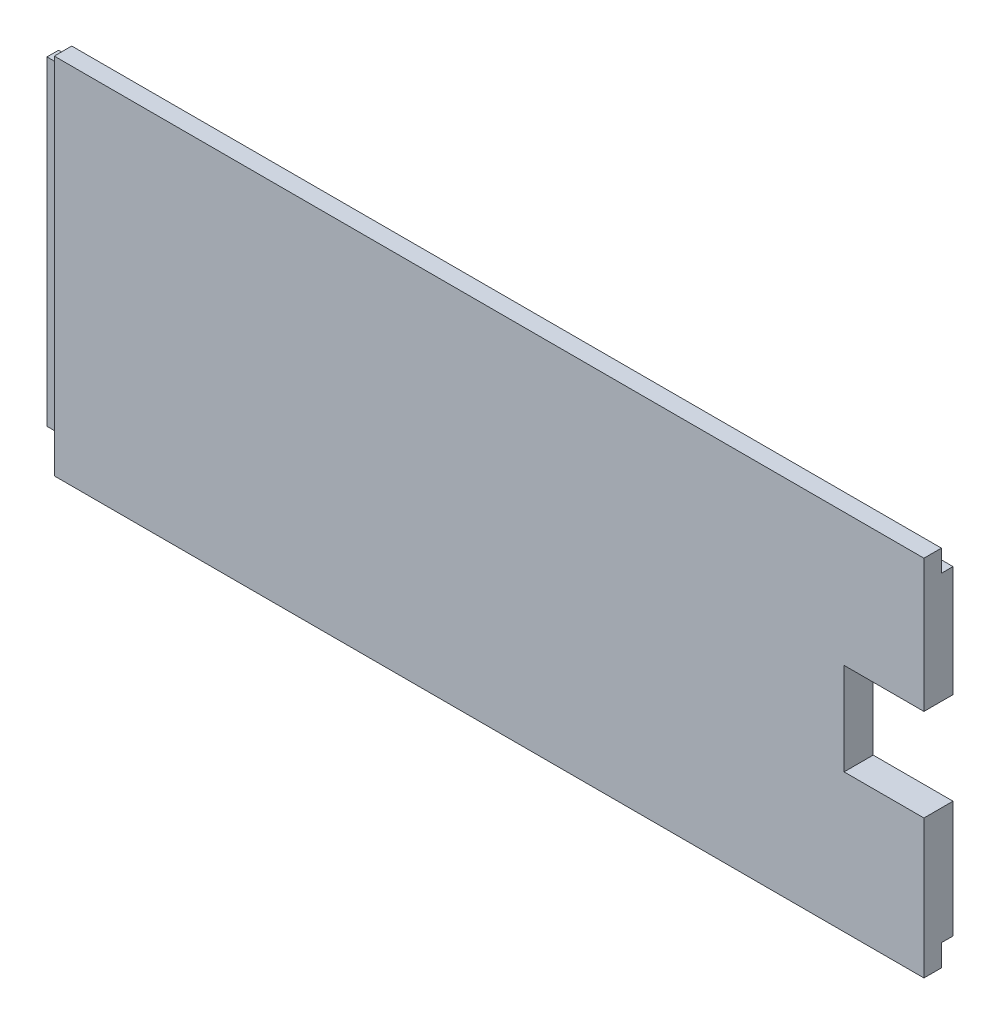
ISO-10303-21;
HEADER;
FILE_DESCRIPTION(('STEP AP214'),'2;1');
FILE_NAME('part.step','',(''),(''),'','','');
FILE_SCHEMA(('AUTOMOTIVE_DESIGN { 1 0 10303 214 1 1 1 1 }'));
ENDSEC;
DATA;
#1=APPLICATION_CONTEXT('core data for automotive mechanical design processes');
#2=APPLICATION_PROTOCOL_DEFINITION('international standard','automotive_design',2000,#1);
#3=PRODUCT_CONTEXT('',#1,'mechanical');
#4=PRODUCT('Part','Part','',(#3));
#5=PRODUCT_RELATED_PRODUCT_CATEGORY('part','',(#4));
#6=PRODUCT_DEFINITION_FORMATION('','',#4);
#7=PRODUCT_DEFINITION_CONTEXT('part definition',#1,'design');
#8=PRODUCT_DEFINITION('design','',#6,#7);
#9=PRODUCT_DEFINITION_SHAPE('','',#8);
#10=(LENGTH_UNIT() NAMED_UNIT(*) SI_UNIT(.MILLI.,.METRE.));
#11=(NAMED_UNIT(*) PLANE_ANGLE_UNIT() SI_UNIT($,.RADIAN.));
#12=(NAMED_UNIT(*) SI_UNIT($,.STERADIAN.) SOLID_ANGLE_UNIT());
#13=UNCERTAINTY_MEASURE_WITH_UNIT(LENGTH_MEASURE(1.E-05),#10,'distance_accuracy_value','');
#14=(GEOMETRIC_REPRESENTATION_CONTEXT(3) GLOBAL_UNCERTAINTY_ASSIGNED_CONTEXT((#13)) GLOBAL_UNIT_ASSIGNED_CONTEXT((#10,
#11,#12)) REPRESENTATION_CONTEXT('',''));
#15=CARTESIAN_POINT('',(0.,0.,0.));
#16=DIRECTION('',(0.,0.,1.));
#17=DIRECTION('',(1.,0.,0.));
#18=AXIS2_PLACEMENT_3D('',#15,#16,#17);
#19=CARTESIAN_POINT('',(153.914845761388,-5.35693257759517,2.032));
#20=DIRECTION('',(-1.,0.,0.));
#21=DIRECTION('',(0.,0.,1.));
#22=AXIS2_PLACEMENT_3D('',#19,#20,#21);
#23=PLANE('',#22);
#24=DIRECTION('',(0.,1.,0.));
#25=VECTOR('',#24,1.);
#26=CARTESIAN_POINT('',(153.914845761388,-5.35693257759517,0.));
#27=LINE('',#26,#25);
#28=CARTESIAN_POINT('',(153.914845761388,-5.35693257759517,0.));
#29=VERTEX_POINT('',#28);
#30=CARTESIAN_POINT('',(153.914845761388,15.0372109981565,0.));
#31=VERTEX_POINT('',#30);
#32=EDGE_CURVE('E166',#29,#31,#27,.T.);
#33=ORIENTED_EDGE('',*,*,#32,.T.);
#34=DIRECTION('',(0.,0.,1.));
#35=VECTOR('',#34,1.);
#36=CARTESIAN_POINT('',(153.914845761388,15.0372109981565,0.));
#37=LINE('',#36,#35);
#38=CARTESIAN_POINT('',(153.914845761388,15.0372109981565,5.08));
#39=VERTEX_POINT('',#38);
#40=EDGE_CURVE('E262',#31,#39,#37,.T.);
#41=ORIENTED_EDGE('',*,*,#40,.T.);
#42=DIRECTION('',(0.,1.,0.));
#43=VECTOR('',#42,1.);
#44=CARTESIAN_POINT('',(153.914845761388,54.3330674224048,5.08));
#45=LINE('',#44,#43);
#46=CARTESIAN_POINT('',(153.914845761388,-9.16693257759518,5.08));
#47=VERTEX_POINT('',#46);
#48=EDGE_CURVE('E247',#47,#39,#45,.T.);
#49=ORIENTED_EDGE('',*,*,#48,.F.);
#50=DIRECTION('',(0.,0.,-1.));
#51=VECTOR('',#50,1.);
#52=CARTESIAN_POINT('',(153.914845761388,-9.16693257759518,5.08));
#53=LINE('',#52,#51);
#54=CARTESIAN_POINT('',(153.914845761388,-9.16693257759518,2.032));
#55=VERTEX_POINT('',#54);
#56=EDGE_CURVE('E208',#47,#55,#53,.T.);
#57=ORIENTED_EDGE('',*,*,#56,.T.);
#58=DIRECTION('',(0.,1.,0.));
#59=VECTOR('',#58,1.);
#60=CARTESIAN_POINT('',(153.914845761388,54.3330674224048,2.032));
#61=LINE('',#60,#59);
#62=CARTESIAN_POINT('',(153.914845761388,-5.35693257759517,2.032));
#63=VERTEX_POINT('',#62);
#64=EDGE_CURVE('E236',#55,#63,#61,.T.);
#65=ORIENTED_EDGE('',*,*,#64,.T.);
#66=DIRECTION('',(0.,0.,-1.));
#67=VECTOR('',#66,1.);
#68=CARTESIAN_POINT('',(153.914845761388,-5.35693257759517,2.032));
#69=LINE('',#68,#67);
#70=EDGE_CURVE('E186',#63,#29,#69,.T.);
#71=ORIENTED_EDGE('',*,*,#70,.T.);
#72=EDGE_LOOP('',(#33,#41,#49,#57,#65,#71));
#73=FACE_BOUND('',#72,.T.);
#74=ADVANCED_FACE('F43',(#73),#23,.F.);
#75=CARTESIAN_POINT('',(0.,0.,2.032));
#76=DIRECTION('',(0.,0.,-1.));
#77=DIRECTION('',(-1.,0.,0.));
#78=AXIS2_PLACEMENT_3D('',#75,#76,#77);
#79=PLANE('',#78);
#80=DIRECTION('',(0.,-1.,0.));
#81=VECTOR('',#80,1.);
#82=CARTESIAN_POINT('',(2.02607794983212,54.3330674224048,2.032));
#83=LINE('',#82,#81);
#84=CARTESIAN_POINT('',(2.02607794983212,50.5230674224048,2.032));
#85=VERTEX_POINT('',#84);
#86=CARTESIAN_POINT('',(2.02607794983212,-5.35693257759515,2.032));
#87=VERTEX_POINT('',#86);
#88=EDGE_CURVE('E11',#85,#87,#83,.T.);
#89=ORIENTED_EDGE('',*,*,#88,.F.);
#90=DIRECTION('',(-1.,0.,0.));
#91=VECTOR('',#90,1.);
#92=CARTESIAN_POINT('',(-2.29515423861217,50.5230674224048,2.032));
#93=LINE('',#92,#91);
#94=CARTESIAN_POINT('',(-2.29515423861217,50.5230674224048,2.032));
#95=VERTEX_POINT('',#94);
#96=EDGE_CURVE('E214',#85,#95,#93,.T.);
#97=ORIENTED_EDGE('',*,*,#96,.T.);
#98=DIRECTION('',(0.,-1.,0.));
#99=VECTOR('',#98,1.);
#100=CARTESIAN_POINT('',(-2.29515423861217,-5.35693257759517,2.032));
#101=LINE('',#100,#99);
#102=CARTESIAN_POINT('',(-2.29515423861217,-5.35693257759517,2.032));
#103=VERTEX_POINT('',#102);
#104=EDGE_CURVE('E178',#95,#103,#101,.T.);
#105=ORIENTED_EDGE('',*,*,#104,.T.);
#106=DIRECTION('',(1.,0.,0.));
#107=VECTOR('',#106,1.);
#108=CARTESIAN_POINT('',(-2.29515423861217,-5.35693257759517,2.032));
#109=LINE('',#108,#107);
#110=EDGE_CURVE('E199',#103,#87,#109,.T.);
#111=ORIENTED_EDGE('',*,*,#110,.T.);
#112=EDGE_LOOP('',(#89,#97,#105,#111));
#113=FACE_BOUND('',#112,.T.);
#114=ADVANCED_FACE('F301',(#113),#79,.F.);
#115=CARTESIAN_POINT('',(-2.29515423861217,-5.35693257759517,2.032));
#116=DIRECTION('',(1.,0.,0.));
#117=DIRECTION('',(0.,0.,-1.));
#118=AXIS2_PLACEMENT_3D('',#115,#116,#117);
#119=PLANE('',#118);
#120=DIRECTION('',(0.,-1.,0.));
#121=VECTOR('',#120,1.);
#122=CARTESIAN_POINT('',(-2.29515423861217,-5.35693257759517,0.));
#123=LINE('',#122,#121);
#124=CARTESIAN_POINT('',(-2.29515423861217,50.5230674224048,0.));
#125=VERTEX_POINT('',#124);
#126=CARTESIAN_POINT('',(-2.29515423861217,-5.35693257759517,0.));
#127=VERTEX_POINT('',#126);
#128=EDGE_CURVE('E172',#125,#127,#123,.T.);
#129=ORIENTED_EDGE('',*,*,#128,.T.);
#130=DIRECTION('',(0.,0.,-1.));
#131=VECTOR('',#130,1.);
#132=CARTESIAN_POINT('',(-2.29515423861217,-5.35693257759517,2.032));
#133=LINE('',#132,#131);
#134=EDGE_CURVE('E47',#103,#127,#133,.T.);
#135=ORIENTED_EDGE('',*,*,#134,.F.);
#136=ORIENTED_EDGE('',*,*,#104,.F.);
#137=DIRECTION('',(0.,0.,-1.));
#138=VECTOR('',#137,1.);
#139=CARTESIAN_POINT('',(-2.29515423861217,50.5230674224048,2.032));
#140=LINE('',#139,#138);
#141=EDGE_CURVE('E179',#95,#125,#140,.T.);
#142=ORIENTED_EDGE('',*,*,#141,.T.);
#143=EDGE_LOOP('',(#129,#135,#136,#142));
#144=FACE_BOUND('',#143,.T.);
#145=ADVANCED_FACE('F45',(#144),#119,.F.);
#146=CARTESIAN_POINT('',(-2.29515423861217,-5.35693257759517,2.032));
#147=DIRECTION('',(0.,1.,0.));
#148=DIRECTION('',(0.,0.,1.));
#149=AXIS2_PLACEMENT_3D('',#146,#147,#148);
#150=PLANE('',#149);
#151=DIRECTION('',(1.,0.,0.));
#152=VECTOR('',#151,1.);
#153=CARTESIAN_POINT('',(-2.29515423861217,-5.35693257759517,0.));
#154=LINE('',#153,#152);
#155=EDGE_CURVE('E167',#127,#29,#154,.T.);
#156=ORIENTED_EDGE('',*,*,#155,.T.);
#157=ORIENTED_EDGE('',*,*,#70,.F.);
#158=EDGE_CURVE('E217',#87,#63,#109,.T.);
#159=ORIENTED_EDGE('',*,*,#158,.F.);
#160=ORIENTED_EDGE('',*,*,#110,.F.);
#161=ORIENTED_EDGE('',*,*,#134,.T.);
#162=EDGE_LOOP('',(#156,#157,#159,#160,#161));
#163=FACE_BOUND('',#162,.T.);
#164=ADVANCED_FACE('F197',(#163),#150,.F.);
#165=CARTESIAN_POINT('',(153.914845761388,31.1487288611217,5.08));
#166=VERTEX_POINT('',#165);
#167=CARTESIAN_POINT('',(153.914845761388,54.3330674224048,5.08));
#168=VERTEX_POINT('',#167);
#169=EDGE_CURVE('E156',#166,#168,#45,.T.);
#170=ORIENTED_EDGE('',*,*,#169,.F.);
#171=DIRECTION('',(0.,0.,1.));
#172=VECTOR('',#171,1.);
#173=CARTESIAN_POINT('',(153.914845761388,31.1487288611217,0.));
#174=LINE('',#173,#172);
#175=CARTESIAN_POINT('',(153.914845761388,31.1487288611217,0.));
#176=VERTEX_POINT('',#175);
#177=EDGE_CURVE('E62',#176,#166,#174,.T.);
#178=ORIENTED_EDGE('',*,*,#177,.F.);
#179=CARTESIAN_POINT('',(153.914845761388,50.5230674224048,0.));
#180=VERTEX_POINT('',#179);
#181=EDGE_CURVE('E153',#176,#180,#27,.T.);
#182=ORIENTED_EDGE('',*,*,#181,.T.);
#183=DIRECTION('',(0.,0.,-1.));
#184=VECTOR('',#183,1.);
#185=CARTESIAN_POINT('',(153.914845761388,50.5230674224048,2.032));
#186=LINE('',#185,#184);
#187=CARTESIAN_POINT('',(153.914845761388,50.5230674224048,2.032));
#188=VERTEX_POINT('',#187);
#189=EDGE_CURVE('E183',#188,#180,#186,.T.);
#190=ORIENTED_EDGE('',*,*,#189,.F.);
#191=CARTESIAN_POINT('',(153.914845761388,54.3330674224048,2.032));
#192=VERTEX_POINT('',#191);
#193=EDGE_CURVE('E239',#188,#192,#61,.T.);
#194=ORIENTED_EDGE('',*,*,#193,.T.);
#195=DIRECTION('',(0.,0.,-1.));
#196=VECTOR('',#195,1.);
#197=CARTESIAN_POINT('',(153.914845761388,54.3330674224048,5.08));
#198=LINE('',#197,#196);
#199=EDGE_CURVE('E223',#168,#192,#198,.T.);
#200=ORIENTED_EDGE('',*,*,#199,.F.);
#201=EDGE_LOOP('',(#170,#178,#182,#190,#194,#200));
#202=FACE_BOUND('',#201,.T.);
#203=ADVANCED_FACE('F152',(#202),#23,.F.);
#204=CARTESIAN_POINT('',(-2.29515423861217,50.5230674224048,2.032));
#205=DIRECTION('',(0.,-1.,0.));
#206=DIRECTION('',(0.,0.,-1.));
#207=AXIS2_PLACEMENT_3D('',#204,#205,#206);
#208=PLANE('',#207);
#209=DIRECTION('',(-1.,0.,0.));
#210=VECTOR('',#209,1.);
#211=CARTESIAN_POINT('',(-2.29515423861217,50.5230674224048,0.));
#212=LINE('',#211,#210);
#213=EDGE_CURVE('E164',#180,#125,#212,.T.);
#214=ORIENTED_EDGE('',*,*,#213,.T.);
#215=ORIENTED_EDGE('',*,*,#141,.F.);
#216=ORIENTED_EDGE('',*,*,#96,.F.);
#217=EDGE_CURVE('E184',#188,#85,#93,.T.);
#218=ORIENTED_EDGE('',*,*,#217,.F.);
#219=ORIENTED_EDGE('',*,*,#189,.T.);
#220=EDGE_LOOP('',(#214,#215,#216,#218,#219));
#221=FACE_BOUND('',#220,.T.);
#222=ADVANCED_FACE('F304',(#221),#208,.F.);
#223=CARTESIAN_POINT('',(0.,0.,0.));
#224=DIRECTION('',(0.,0.,-1.));
#225=DIRECTION('',(-1.,0.,0.));
#226=AXIS2_PLACEMENT_3D('',#223,#224,#225);
#227=PLANE('',#226);
#228=DIRECTION('',(1.,0.,0.));
#229=VECTOR('',#228,1.);
#230=CARTESIAN_POINT('',(153.914845761388,15.0372109981565,0.));
#231=LINE('',#230,#229);
#232=CARTESIAN_POINT('',(139.973048170908,15.0372109981565,0.));
#233=VERTEX_POINT('',#232);
#234=EDGE_CURVE('E158',#233,#31,#231,.T.);
#235=ORIENTED_EDGE('',*,*,#234,.T.);
#236=ORIENTED_EDGE('',*,*,#32,.F.);
#237=ORIENTED_EDGE('',*,*,#155,.F.);
#238=ORIENTED_EDGE('',*,*,#128,.F.);
#239=ORIENTED_EDGE('',*,*,#213,.F.);
#240=ORIENTED_EDGE('',*,*,#181,.F.);
#241=DIRECTION('',(-1.,0.,0.));
#242=VECTOR('',#241,1.);
#243=CARTESIAN_POINT('',(153.914845761388,31.1487288611217,0.));
#244=LINE('',#243,#242);
#245=CARTESIAN_POINT('',(139.973048170908,31.1487288611217,0.));
#246=VERTEX_POINT('',#245);
#247=EDGE_CURVE('E139',#176,#246,#244,.T.);
#248=ORIENTED_EDGE('',*,*,#247,.T.);
#249=DIRECTION('',(0.,-1.,0.));
#250=VECTOR('',#249,1.);
#251=CARTESIAN_POINT('',(139.973048170908,15.0372109981565,0.));
#252=LINE('',#251,#250);
#253=EDGE_CURVE('E147',#246,#233,#252,.T.);
#254=ORIENTED_EDGE('',*,*,#253,.T.);
#255=EDGE_LOOP('',(#235,#236,#237,#238,#239,#240,#248,#254));
#256=FACE_BOUND('',#255,.T.);
#257=ADVANCED_FACE('F162',(#256),#227,.T.);
#258=CARTESIAN_POINT('',(0.,0.,2.032));
#259=DIRECTION('',(0.,0.,1.));
#260=DIRECTION('',(1.,0.,0.));
#261=AXIS2_PLACEMENT_3D('',#258,#259,#260);
#262=PLANE('',#261);
#263=CARTESIAN_POINT('',(2.02607794983212,-9.16693257759518,2.032));
#264=VERTEX_POINT('',#263);
#265=EDGE_CURVE('E55',#87,#264,#83,.T.);
#266=ORIENTED_EDGE('',*,*,#265,.F.);
#267=ORIENTED_EDGE('',*,*,#158,.T.);
#268=ORIENTED_EDGE('',*,*,#64,.F.);
#269=DIRECTION('',(1.,0.,0.));
#270=VECTOR('',#269,1.);
#271=CARTESIAN_POINT('',(2.02607794983212,-9.16693257759518,2.032));
#272=LINE('',#271,#270);
#273=EDGE_CURVE('E240',#264,#55,#272,.T.);
#274=ORIENTED_EDGE('',*,*,#273,.F.);
#275=EDGE_LOOP('',(#266,#267,#268,#274));
#276=FACE_BOUND('',#275,.T.);
#277=ADVANCED_FACE('F298',(#276),#262,.F.);
#278=ORIENTED_EDGE('',*,*,#193,.F.);
#279=ORIENTED_EDGE('',*,*,#217,.T.);
#280=CARTESIAN_POINT('',(2.02607794983212,54.3330674224048,2.032));
#281=VERTEX_POINT('',#280);
#282=EDGE_CURVE('E54',#281,#85,#83,.T.);
#283=ORIENTED_EDGE('',*,*,#282,.F.);
#284=DIRECTION('',(-1.,0.,0.));
#285=VECTOR('',#284,1.);
#286=CARTESIAN_POINT('',(2.02607794983212,54.3330674224048,2.032));
#287=LINE('',#286,#285);
#288=EDGE_CURVE('E232',#192,#281,#287,.T.);
#289=ORIENTED_EDGE('',*,*,#288,.F.);
#290=EDGE_LOOP('',(#278,#279,#283,#289));
#291=FACE_BOUND('',#290,.T.);
#292=ADVANCED_FACE('F314',(#291),#262,.F.);
#293=CARTESIAN_POINT('',(2.02607794983212,54.3330674224048,5.08));
#294=DIRECTION('',(1.,0.,0.));
#295=DIRECTION('',(0.,0.,-1.));
#296=AXIS2_PLACEMENT_3D('',#293,#294,#295);
#297=PLANE('',#296);
#298=ORIENTED_EDGE('',*,*,#282,.T.);
#299=ORIENTED_EDGE('',*,*,#88,.T.);
#300=ORIENTED_EDGE('',*,*,#265,.T.);
#301=DIRECTION('',(0.,0.,-1.));
#302=VECTOR('',#301,1.);
#303=CARTESIAN_POINT('',(2.02607794983212,-9.16693257759518,5.08));
#304=LINE('',#303,#302);
#305=CARTESIAN_POINT('',(2.02607794983212,-9.16693257759518,5.08));
#306=VERTEX_POINT('',#305);
#307=EDGE_CURVE('E205',#306,#264,#304,.T.);
#308=ORIENTED_EDGE('',*,*,#307,.F.);
#309=DIRECTION('',(0.,-1.,0.));
#310=VECTOR('',#309,1.);
#311=CARTESIAN_POINT('',(2.02607794983212,54.3330674224048,5.08));
#312=LINE('',#311,#310);
#313=CARTESIAN_POINT('',(2.02607794983212,54.3330674224048,5.08));
#314=VERTEX_POINT('',#313);
#315=EDGE_CURVE('E235',#314,#306,#312,.T.);
#316=ORIENTED_EDGE('',*,*,#315,.F.);
#317=DIRECTION('',(0.,0.,-1.));
#318=VECTOR('',#317,1.);
#319=CARTESIAN_POINT('',(2.02607794983212,54.3330674224048,5.08));
#320=LINE('',#319,#318);
#321=EDGE_CURVE('E227',#314,#281,#320,.T.);
#322=ORIENTED_EDGE('',*,*,#321,.T.);
#323=EDGE_LOOP('',(#298,#299,#300,#308,#316,#322));
#324=FACE_BOUND('',#323,.T.);
#325=ADVANCED_FACE('F316',(#324),#297,.F.);
#326=CARTESIAN_POINT('',(2.02607794983212,-9.16693257759518,5.08));
#327=DIRECTION('',(0.,1.,0.));
#328=DIRECTION('',(0.,0.,1.));
#329=AXIS2_PLACEMENT_3D('',#326,#327,#328);
#330=PLANE('',#329);
#331=ORIENTED_EDGE('',*,*,#273,.T.);
#332=ORIENTED_EDGE('',*,*,#56,.F.);
#333=DIRECTION('',(1.,0.,0.));
#334=VECTOR('',#333,1.);
#335=CARTESIAN_POINT('',(2.02607794983212,-9.16693257759518,5.08));
#336=LINE('',#335,#334);
#337=EDGE_CURVE('E251',#306,#47,#336,.T.);
#338=ORIENTED_EDGE('',*,*,#337,.F.);
#339=ORIENTED_EDGE('',*,*,#307,.T.);
#340=EDGE_LOOP('',(#331,#332,#338,#339));
#341=FACE_BOUND('',#340,.T.);
#342=ADVANCED_FACE('F292',(#341),#330,.F.);
#343=CARTESIAN_POINT('',(2.02607794983212,54.3330674224048,5.08));
#344=DIRECTION('',(0.,-1.,0.));
#345=DIRECTION('',(0.,0.,-1.));
#346=AXIS2_PLACEMENT_3D('',#343,#344,#345);
#347=PLANE('',#346);
#348=ORIENTED_EDGE('',*,*,#288,.T.);
#349=ORIENTED_EDGE('',*,*,#321,.F.);
#350=DIRECTION('',(-1.,0.,0.));
#351=VECTOR('',#350,1.);
#352=CARTESIAN_POINT('',(2.02607794983212,54.3330674224048,5.08));
#353=LINE('',#352,#351);
#354=EDGE_CURVE('E231',#168,#314,#353,.T.);
#355=ORIENTED_EDGE('',*,*,#354,.F.);
#356=ORIENTED_EDGE('',*,*,#199,.T.);
#357=EDGE_LOOP('',(#348,#349,#355,#356));
#358=FACE_BOUND('',#357,.T.);
#359=ADVANCED_FACE('F311',(#358),#347,.F.);
#360=CARTESIAN_POINT('',(0.,0.,5.08));
#361=DIRECTION('',(0.,0.,1.));
#362=DIRECTION('',(1.,0.,0.));
#363=AXIS2_PLACEMENT_3D('',#360,#361,#362);
#364=PLANE('',#363);
#365=DIRECTION('',(1.,0.,0.));
#366=VECTOR('',#365,1.);
#367=CARTESIAN_POINT('',(153.914845761388,15.0372109981565,5.08));
#368=LINE('',#367,#366);
#369=CARTESIAN_POINT('',(139.973048170908,15.0372109981565,5.08));
#370=VERTEX_POINT('',#369);
#371=EDGE_CURVE('E148',#370,#39,#368,.T.);
#372=ORIENTED_EDGE('',*,*,#371,.F.);
#373=DIRECTION('',(0.,-1.,0.));
#374=VECTOR('',#373,1.);
#375=CARTESIAN_POINT('',(139.973048170908,15.0372109981565,5.08));
#376=LINE('',#375,#374);
#377=CARTESIAN_POINT('',(139.973048170908,31.1487288611217,5.08));
#378=VERTEX_POINT('',#377);
#379=EDGE_CURVE('E268',#378,#370,#376,.T.);
#380=ORIENTED_EDGE('',*,*,#379,.F.);
#381=DIRECTION('',(-1.,0.,0.));
#382=VECTOR('',#381,1.);
#383=CARTESIAN_POINT('',(153.914845761388,31.1487288611217,5.08));
#384=LINE('',#383,#382);
#385=EDGE_CURVE('E272',#166,#378,#384,.T.);
#386=ORIENTED_EDGE('',*,*,#385,.F.);
#387=ORIENTED_EDGE('',*,*,#169,.T.);
#388=ORIENTED_EDGE('',*,*,#354,.T.);
#389=ORIENTED_EDGE('',*,*,#315,.T.);
#390=ORIENTED_EDGE('',*,*,#337,.T.);
#391=ORIENTED_EDGE('',*,*,#48,.T.);
#392=EDGE_LOOP('',(#372,#380,#386,#387,#388,#389,#390,#391));
#393=FACE_BOUND('',#392,.T.);
#394=ADVANCED_FACE('F287',(#393),#364,.T.);
#395=CARTESIAN_POINT('',(153.914845761388,15.0372109981565,0.));
#396=DIRECTION('',(0.,-1.,0.));
#397=DIRECTION('',(0.,0.,-1.));
#398=AXIS2_PLACEMENT_3D('',#395,#396,#397);
#399=PLANE('',#398);
#400=ORIENTED_EDGE('',*,*,#371,.T.);
#401=ORIENTED_EDGE('',*,*,#40,.F.);
#402=ORIENTED_EDGE('',*,*,#234,.F.);
#403=DIRECTION('',(0.,0.,1.));
#404=VECTOR('',#403,1.);
#405=CARTESIAN_POINT('',(139.973048170908,15.0372109981565,0.));
#406=LINE('',#405,#404);
#407=EDGE_CURVE('E259',#233,#370,#406,.T.);
#408=ORIENTED_EDGE('',*,*,#407,.T.);
#409=EDGE_LOOP('',(#400,#401,#402,#408));
#410=FACE_BOUND('',#409,.T.);
#411=ADVANCED_FACE('F284',(#410),#399,.F.);
#412=CARTESIAN_POINT('',(139.973048170908,15.0372109981565,0.));
#413=DIRECTION('',(-1.,0.,0.));
#414=DIRECTION('',(0.,0.,1.));
#415=AXIS2_PLACEMENT_3D('',#412,#413,#414);
#416=PLANE('',#415);
#417=ORIENTED_EDGE('',*,*,#379,.T.);
#418=ORIENTED_EDGE('',*,*,#407,.F.);
#419=ORIENTED_EDGE('',*,*,#253,.F.);
#420=DIRECTION('',(0.,0.,1.));
#421=VECTOR('',#420,1.);
#422=CARTESIAN_POINT('',(139.973048170908,31.1487288611217,0.));
#423=LINE('',#422,#421);
#424=EDGE_CURVE('E141',#246,#378,#423,.T.);
#425=ORIENTED_EDGE('',*,*,#424,.T.);
#426=EDGE_LOOP('',(#417,#418,#419,#425));
#427=FACE_BOUND('',#426,.T.);
#428=ADVANCED_FACE('F280',(#427),#416,.F.);
#429=CARTESIAN_POINT('',(153.914845761388,31.1487288611217,0.));
#430=DIRECTION('',(0.,1.,0.));
#431=DIRECTION('',(0.,0.,1.));
#432=AXIS2_PLACEMENT_3D('',#429,#430,#431);
#433=PLANE('',#432);
#434=ORIENTED_EDGE('',*,*,#385,.T.);
#435=ORIENTED_EDGE('',*,*,#424,.F.);
#436=ORIENTED_EDGE('',*,*,#247,.F.);
#437=ORIENTED_EDGE('',*,*,#177,.T.);
#438=EDGE_LOOP('',(#434,#435,#436,#437));
#439=FACE_BOUND('',#438,.T.);
#440=ADVANCED_FACE('F140',(#439),#433,.F.);
#441=CLOSED_SHELL('',(#74,#114,#145,#164,#203,#222,#257,#277,#292,#325,#342,#359,#394,#411,#428,#440));
#442=MANIFOLD_SOLID_BREP('B2',#441);
#443=ADVANCED_BREP_SHAPE_REPRESENTATION('',(#18,#442),#14);
#444=SHAPE_DEFINITION_REPRESENTATION(#9,#443);
ENDSEC;
END-ISO-10303-21;
